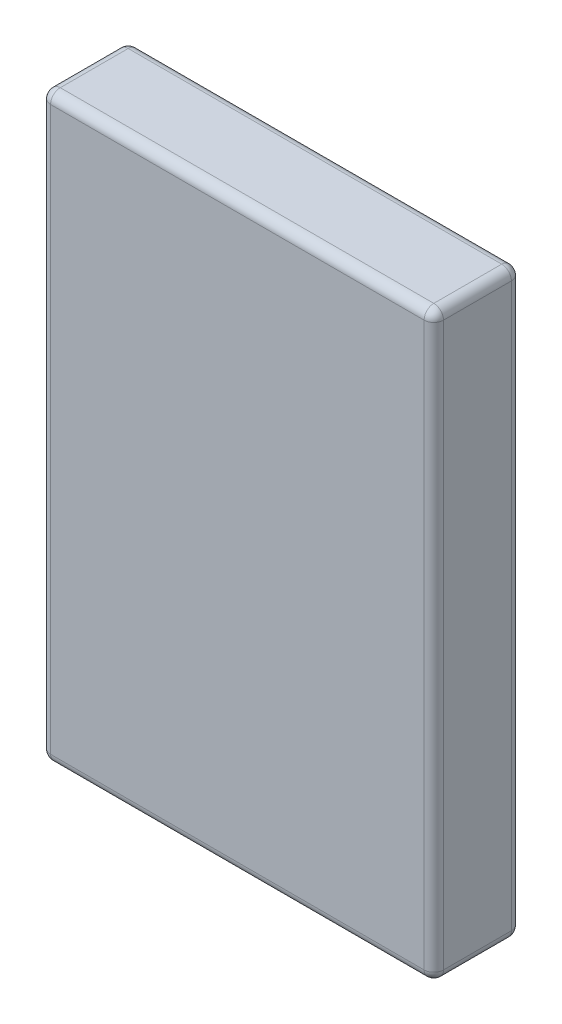
ISO-10303-21;
HEADER;
FILE_DESCRIPTION(('STEP AP214'),'2;1');
FILE_NAME('part.step','',(''),(''),'','','');
FILE_SCHEMA(('AUTOMOTIVE_DESIGN { 1 0 10303 214 1 1 1 1 }'));
ENDSEC;
DATA;
#1=APPLICATION_CONTEXT('core data for automotive mechanical design processes');
#2=APPLICATION_PROTOCOL_DEFINITION('international standard','automotive_design',2000,#1);
#3=PRODUCT_CONTEXT('',#1,'mechanical');
#4=PRODUCT('Part','Part','',(#3));
#5=PRODUCT_RELATED_PRODUCT_CATEGORY('part','',(#4));
#6=PRODUCT_DEFINITION_FORMATION('','',#4);
#7=PRODUCT_DEFINITION_CONTEXT('part definition',#1,'design');
#8=PRODUCT_DEFINITION('design','',#6,#7);
#9=PRODUCT_DEFINITION_SHAPE('','',#8);
#10=(LENGTH_UNIT() NAMED_UNIT(*) SI_UNIT(.MILLI.,.METRE.));
#11=(NAMED_UNIT(*) PLANE_ANGLE_UNIT() SI_UNIT($,.RADIAN.));
#12=(NAMED_UNIT(*) SI_UNIT($,.STERADIAN.) SOLID_ANGLE_UNIT());
#13=UNCERTAINTY_MEASURE_WITH_UNIT(LENGTH_MEASURE(1.E-05),#10,'distance_accuracy_value','');
#14=(GEOMETRIC_REPRESENTATION_CONTEXT(3) GLOBAL_UNCERTAINTY_ASSIGNED_CONTEXT((#13)) GLOBAL_UNIT_ASSIGNED_CONTEXT((#10,
#11,#12)) REPRESENTATION_CONTEXT('',''));
#15=CARTESIAN_POINT('',(0.,0.,0.));
#16=DIRECTION('',(0.,0.,1.));
#17=DIRECTION('',(1.,0.,0.));
#18=AXIS2_PLACEMENT_3D('',#15,#16,#17);
#19=CARTESIAN_POINT('',(81.,240.,-18.));
#20=DIRECTION('',(-1.,0.,0.));
#21=DIRECTION('',(0.,0.,1.));
#22=AXIS2_PLACEMENT_3D('',#19,#20,#21);
#23=PLANE('',#22);
#24=DIRECTION('',(0.,0.,-1.));
#25=VECTOR('',#24,1.);
#26=CARTESIAN_POINT('',(81.,4.,-18.));
#27=LINE('',#26,#25);
#28=CARTESIAN_POINT('',(81.,4.,14.));
#29=VERTEX_POINT('',#28);
#30=CARTESIAN_POINT('',(81.,4.,-14.));
#31=VERTEX_POINT('',#30);
#32=EDGE_CURVE('E42',#29,#31,#27,.T.);
#33=ORIENTED_EDGE('',*,*,#32,.T.);
#34=DIRECTION('',(0.,-1.,0.));
#35=VECTOR('',#34,1.);
#36=CARTESIAN_POINT('',(81.,240.,-14.));
#37=LINE('',#36,#35);
#38=CARTESIAN_POINT('',(81.,236.,-14.));
#39=VERTEX_POINT('',#38);
#40=EDGE_CURVE('E11',#31,#39,#37,.F.);
#41=ORIENTED_EDGE('',*,*,#40,.T.);
#42=DIRECTION('',(0.,0.,-1.));
#43=VECTOR('',#42,1.);
#44=CARTESIAN_POINT('',(81.,236.,18.));
#45=LINE('',#44,#43);
#46=CARTESIAN_POINT('',(81.,236.,14.));
#47=VERTEX_POINT('',#46);
#48=EDGE_CURVE('E200',#39,#47,#45,.F.);
#49=ORIENTED_EDGE('',*,*,#48,.T.);
#50=DIRECTION('',(0.,-1.,0.));
#51=VECTOR('',#50,1.);
#52=CARTESIAN_POINT('',(81.,240.,14.));
#53=LINE('',#52,#51);
#54=EDGE_CURVE('E198',#47,#29,#53,.T.);
#55=ORIENTED_EDGE('',*,*,#54,.T.);
#56=EDGE_LOOP('',(#33,#41,#49,#55));
#57=FACE_BOUND('',#56,.T.);
#58=ADVANCED_FACE('F33',(#57),#23,.F.);
#59=CARTESIAN_POINT('',(-81.,240.,-18.));
#60=DIRECTION('',(0.,0.,1.));
#61=DIRECTION('',(1.,0.,0.));
#62=AXIS2_PLACEMENT_3D('',#59,#60,#61);
#63=PLANE('',#62);
#64=DIRECTION('',(-1.,0.,0.));
#65=VECTOR('',#64,1.);
#66=CARTESIAN_POINT('',(-81.,4.,-18.));
#67=LINE('',#66,#65);
#68=CARTESIAN_POINT('',(77.,4.,-18.));
#69=VERTEX_POINT('',#68);
#70=CARTESIAN_POINT('',(-77.,4.,-18.));
#71=VERTEX_POINT('',#70);
#72=EDGE_CURVE('E168',#69,#71,#67,.T.);
#73=ORIENTED_EDGE('',*,*,#72,.T.);
#74=DIRECTION('',(0.,-1.,0.));
#75=VECTOR('',#74,1.);
#76=CARTESIAN_POINT('',(-77.,240.,-18.));
#77=LINE('',#76,#75);
#78=CARTESIAN_POINT('',(-77.,236.,-18.));
#79=VERTEX_POINT('',#78);
#80=EDGE_CURVE('E132',#71,#79,#77,.F.);
#81=ORIENTED_EDGE('',*,*,#80,.T.);
#82=DIRECTION('',(-1.,0.,0.));
#83=VECTOR('',#82,1.);
#84=CARTESIAN_POINT('',(81.,236.,-18.));
#85=LINE('',#84,#83);
#86=CARTESIAN_POINT('',(77.,236.,-18.));
#87=VERTEX_POINT('',#86);
#88=EDGE_CURVE('E160',#79,#87,#85,.F.);
#89=ORIENTED_EDGE('',*,*,#88,.T.);
#90=DIRECTION('',(0.,-1.,0.));
#91=VECTOR('',#90,1.);
#92=CARTESIAN_POINT('',(77.,240.,-18.));
#93=LINE('',#92,#91);
#94=EDGE_CURVE('E162',#87,#69,#93,.T.);
#95=ORIENTED_EDGE('',*,*,#94,.T.);
#96=EDGE_LOOP('',(#73,#81,#89,#95));
#97=FACE_BOUND('',#96,.T.);
#98=ADVANCED_FACE('F300',(#97),#63,.F.);
#99=CARTESIAN_POINT('',(-81.,240.,-18.));
#100=DIRECTION('',(1.,0.,0.));
#101=DIRECTION('',(0.,0.,-1.));
#102=AXIS2_PLACEMENT_3D('',#99,#100,#101);
#103=PLANE('',#102);
#104=DIRECTION('',(0.,0.,1.));
#105=VECTOR('',#104,1.);
#106=CARTESIAN_POINT('',(-81.,236.,-18.));
#107=LINE('',#106,#105);
#108=CARTESIAN_POINT('',(-81.,236.,14.));
#109=VERTEX_POINT('',#108);
#110=CARTESIAN_POINT('',(-81.,236.,-14.));
#111=VERTEX_POINT('',#110);
#112=EDGE_CURVE('E158',#109,#111,#107,.F.);
#113=ORIENTED_EDGE('',*,*,#112,.T.);
#114=DIRECTION('',(0.,-1.,0.));
#115=VECTOR('',#114,1.);
#116=CARTESIAN_POINT('',(-81.,240.,-14.));
#117=LINE('',#116,#115);
#118=CARTESIAN_POINT('',(-81.,4.,-14.));
#119=VERTEX_POINT('',#118);
#120=EDGE_CURVE('E130',#111,#119,#117,.T.);
#121=ORIENTED_EDGE('',*,*,#120,.T.);
#122=DIRECTION('',(0.,0.,1.));
#123=VECTOR('',#122,1.);
#124=CARTESIAN_POINT('',(-81.,4.,-18.));
#125=LINE('',#124,#123);
#126=CARTESIAN_POINT('',(-81.,4.,14.));
#127=VERTEX_POINT('',#126);
#128=EDGE_CURVE('E148',#119,#127,#125,.T.);
#129=ORIENTED_EDGE('',*,*,#128,.T.);
#130=DIRECTION('',(0.,-1.,0.));
#131=VECTOR('',#130,1.);
#132=CARTESIAN_POINT('',(-81.,240.,14.));
#133=LINE('',#132,#131);
#134=EDGE_CURVE('E154',#127,#109,#133,.F.);
#135=ORIENTED_EDGE('',*,*,#134,.T.);
#136=EDGE_LOOP('',(#113,#121,#129,#135));
#137=FACE_BOUND('',#136,.T.);
#138=ADVANCED_FACE('F156',(#137),#103,.F.);
#139=CARTESIAN_POINT('',(-81.,240.,18.));
#140=DIRECTION('',(0.,0.,-1.));
#141=DIRECTION('',(-1.,0.,0.));
#142=AXIS2_PLACEMENT_3D('',#139,#140,#141);
#143=PLANE('',#142);
#144=DIRECTION('',(1.,0.,0.));
#145=VECTOR('',#144,1.);
#146=CARTESIAN_POINT('',(-81.,236.,18.));
#147=LINE('',#146,#145);
#148=CARTESIAN_POINT('',(77.,236.,18.));
#149=VERTEX_POINT('',#148);
#150=CARTESIAN_POINT('',(-77.,236.,18.));
#151=VERTEX_POINT('',#150);
#152=EDGE_CURVE('E180',#149,#151,#147,.F.);
#153=ORIENTED_EDGE('',*,*,#152,.T.);
#154=DIRECTION('',(0.,-1.,0.));
#155=VECTOR('',#154,1.);
#156=CARTESIAN_POINT('',(-77.,240.,18.));
#157=LINE('',#156,#155);
#158=CARTESIAN_POINT('',(-77.,4.,18.));
#159=VERTEX_POINT('',#158);
#160=EDGE_CURVE('E186',#151,#159,#157,.T.);
#161=ORIENTED_EDGE('',*,*,#160,.T.);
#162=DIRECTION('',(1.,0.,0.));
#163=VECTOR('',#162,1.);
#164=CARTESIAN_POINT('',(-81.,4.,18.));
#165=LINE('',#164,#163);
#166=CARTESIAN_POINT('',(77.,4.,18.));
#167=VERTEX_POINT('',#166);
#168=EDGE_CURVE('E184',#159,#167,#165,.T.);
#169=ORIENTED_EDGE('',*,*,#168,.T.);
#170=DIRECTION('',(0.,-1.,0.));
#171=VECTOR('',#170,1.);
#172=CARTESIAN_POINT('',(77.,240.,18.));
#173=LINE('',#172,#171);
#174=EDGE_CURVE('E182',#167,#149,#173,.F.);
#175=ORIENTED_EDGE('',*,*,#174,.T.);
#176=EDGE_LOOP('',(#153,#161,#169,#175));
#177=FACE_BOUND('',#176,.T.);
#178=ADVANCED_FACE('F282',(#177),#143,.F.);
#179=CARTESIAN_POINT('',(0.,240.,0.));
#180=DIRECTION('',(0.,1.,0.));
#181=DIRECTION('',(0.,0.,1.));
#182=AXIS2_PLACEMENT_3D('',#179,#180,#181);
#183=PLANE('',#182);
#184=DIRECTION('',(0.,0.,-1.));
#185=VECTOR('',#184,1.);
#186=CARTESIAN_POINT('',(77.,240.,-18.));
#187=LINE('',#186,#185);
#188=CARTESIAN_POINT('',(77.,240.,14.));
#189=VERTEX_POINT('',#188);
#190=CARTESIAN_POINT('',(77.,240.,-14.));
#191=VERTEX_POINT('',#190);
#192=EDGE_CURVE('E173',#189,#191,#187,.T.);
#193=ORIENTED_EDGE('',*,*,#192,.T.);
#194=DIRECTION('',(-1.,0.,0.));
#195=VECTOR('',#194,1.);
#196=CARTESIAN_POINT('',(-81.,240.,-14.));
#197=LINE('',#196,#195);
#198=CARTESIAN_POINT('',(-77.,240.,-14.));
#199=VERTEX_POINT('',#198);
#200=EDGE_CURVE('E178',#191,#199,#197,.T.);
#201=ORIENTED_EDGE('',*,*,#200,.T.);
#202=DIRECTION('',(0.,0.,1.));
#203=VECTOR('',#202,1.);
#204=CARTESIAN_POINT('',(-77.,240.,18.));
#205=LINE('',#204,#203);
#206=CARTESIAN_POINT('',(-77.,240.,14.));
#207=VERTEX_POINT('',#206);
#208=EDGE_CURVE('E175',#199,#207,#205,.T.);
#209=ORIENTED_EDGE('',*,*,#208,.T.);
#210=DIRECTION('',(1.,0.,0.));
#211=VECTOR('',#210,1.);
#212=CARTESIAN_POINT('',(81.,240.,14.));
#213=LINE('',#212,#211);
#214=EDGE_CURVE('E171',#207,#189,#213,.T.);
#215=ORIENTED_EDGE('',*,*,#214,.T.);
#216=EDGE_LOOP('',(#193,#201,#209,#215));
#217=FACE_BOUND('',#216,.T.);
#218=ADVANCED_FACE('F273',(#217),#183,.T.);
#219=CARTESIAN_POINT('',(0.,0.,0.));
#220=DIRECTION('',(0.,1.,0.));
#221=DIRECTION('',(0.,0.,1.));
#222=AXIS2_PLACEMENT_3D('',#219,#220,#221);
#223=PLANE('',#222);
#224=DIRECTION('',(0.,0.,1.));
#225=VECTOR('',#224,1.);
#226=CARTESIAN_POINT('',(-77.,0.,0.));
#227=LINE('',#226,#225);
#228=CARTESIAN_POINT('',(-77.,0.,14.));
#229=VERTEX_POINT('',#228);
#230=CARTESIAN_POINT('',(-77.,0.,-14.));
#231=VERTEX_POINT('',#230);
#232=EDGE_CURVE('E193',#229,#231,#227,.F.);
#233=ORIENTED_EDGE('',*,*,#232,.T.);
#234=DIRECTION('',(-1.,0.,0.));
#235=VECTOR('',#234,1.);
#236=CARTESIAN_POINT('',(0.,0.,-14.));
#237=LINE('',#236,#235);
#238=CARTESIAN_POINT('',(77.,0.,-14.));
#239=VERTEX_POINT('',#238);
#240=EDGE_CURVE('E196',#231,#239,#237,.F.);
#241=ORIENTED_EDGE('',*,*,#240,.T.);
#242=DIRECTION('',(0.,0.,-1.));
#243=VECTOR('',#242,1.);
#244=CARTESIAN_POINT('',(77.,0.,0.));
#245=LINE('',#244,#243);
#246=CARTESIAN_POINT('',(77.,0.,14.));
#247=VERTEX_POINT('',#246);
#248=EDGE_CURVE('E191',#239,#247,#245,.F.);
#249=ORIENTED_EDGE('',*,*,#248,.T.);
#250=DIRECTION('',(1.,0.,0.));
#251=VECTOR('',#250,1.);
#252=CARTESIAN_POINT('',(0.,0.,14.));
#253=LINE('',#252,#251);
#254=EDGE_CURVE('E189',#247,#229,#253,.F.);
#255=ORIENTED_EDGE('',*,*,#254,.T.);
#256=EDGE_LOOP('',(#233,#241,#249,#255));
#257=FACE_BOUND('',#256,.T.);
#258=ADVANCED_FACE('F364',(#257),#223,.F.);
#259=CARTESIAN_POINT('',(77.,240.,14.));
#260=DIRECTION('',(0.,-1.,0.));
#261=DIRECTION('',(0.,0.,-1.));
#262=AXIS2_PLACEMENT_3D('',#259,#260,#261);
#263=CYLINDRICAL_SURFACE('',#262,4.);
#264=CARTESIAN_POINT('',(77.,236.,14.));
#265=DIRECTION('',(0.,1.,0.));
#266=DIRECTION('',(0.,0.,1.));
#267=AXIS2_PLACEMENT_3D('',#264,#265,#266);
#268=CIRCLE('',#267,4.);
#269=EDGE_CURVE('E37',#149,#47,#268,.T.);
#270=ORIENTED_EDGE('',*,*,#269,.F.);
#271=ORIENTED_EDGE('',*,*,#174,.F.);
#272=CARTESIAN_POINT('',(77.,4.,14.));
#273=DIRECTION('',(0.,-1.,0.));
#274=DIRECTION('',(0.,0.,-1.));
#275=AXIS2_PLACEMENT_3D('',#272,#273,#274);
#276=CIRCLE('',#275,4.);
#277=EDGE_CURVE('E250',#29,#167,#276,.T.);
#278=ORIENTED_EDGE('',*,*,#277,.F.);
#279=ORIENTED_EDGE('',*,*,#54,.F.);
#280=EDGE_LOOP('',(#270,#271,#278,#279));
#281=FACE_BOUND('',#280,.T.);
#282=ADVANCED_FACE('F35',(#281),#263,.T.);
#283=CARTESIAN_POINT('',(77.,236.,14.));
#284=DIRECTION('',(0.,0.,1.));
#285=DIRECTION('',(1.,0.,0.));
#286=AXIS2_PLACEMENT_3D('',#283,#284,#285);
#287=SPHERICAL_SURFACE('',#286,4.);
#288=CARTESIAN_POINT('',(77.,236.,14.));
#289=DIRECTION('',(1.,0.,0.));
#290=DIRECTION('',(0.,0.,-1.));
#291=AXIS2_PLACEMENT_3D('',#288,#289,#290);
#292=CIRCLE('',#291,4.);
#293=EDGE_CURVE('E245',#149,#189,#292,.F.);
#294=ORIENTED_EDGE('',*,*,#293,.F.);
#295=ORIENTED_EDGE('',*,*,#269,.T.);
#296=CARTESIAN_POINT('',(77.,236.,14.));
#297=DIRECTION('',(0.,0.,1.));
#298=DIRECTION('',(0.,-1.,0.));
#299=AXIS2_PLACEMENT_3D('',#296,#297,#298);
#300=CIRCLE('',#299,4.);
#301=EDGE_CURVE('E248',#189,#47,#300,.F.);
#302=ORIENTED_EDGE('',*,*,#301,.F.);
#303=EDGE_LOOP('',(#294,#295,#302));
#304=FACE_BOUND('',#303,.T.);
#305=ADVANCED_FACE('F261',(#304),#287,.T.);
#306=CARTESIAN_POINT('',(77.,4.,14.));
#307=DIRECTION('',(0.,0.,1.));
#308=DIRECTION('',(1.,0.,0.));
#309=AXIS2_PLACEMENT_3D('',#306,#307,#308);
#310=SPHERICAL_SURFACE('',#309,4.);
#311=CARTESIAN_POINT('',(77.,4.,14.));
#312=DIRECTION('',(0.,0.,1.));
#313=DIRECTION('',(1.,0.,0.));
#314=AXIS2_PLACEMENT_3D('',#311,#312,#313);
#315=CIRCLE('',#314,4.);
#316=EDGE_CURVE('E239',#29,#247,#315,.F.);
#317=ORIENTED_EDGE('',*,*,#316,.F.);
#318=ORIENTED_EDGE('',*,*,#277,.T.);
#319=CARTESIAN_POINT('',(77.,4.,14.));
#320=DIRECTION('',(1.,0.,0.));
#321=DIRECTION('',(0.,0.,-1.));
#322=AXIS2_PLACEMENT_3D('',#319,#320,#321);
#323=CIRCLE('',#322,4.);
#324=EDGE_CURVE('E242',#247,#167,#323,.F.);
#325=ORIENTED_EDGE('',*,*,#324,.F.);
#326=EDGE_LOOP('',(#317,#318,#325));
#327=FACE_BOUND('',#326,.T.);
#328=ADVANCED_FACE('F295',(#327),#310,.T.);
#329=CARTESIAN_POINT('',(77.,236.,0.));
#330=DIRECTION('',(0.,0.,1.));
#331=DIRECTION('',(1.,0.,0.));
#332=AXIS2_PLACEMENT_3D('',#329,#330,#331);
#333=CYLINDRICAL_SURFACE('',#332,4.);
#334=ORIENTED_EDGE('',*,*,#301,.T.);
#335=ORIENTED_EDGE('',*,*,#48,.F.);
#336=CARTESIAN_POINT('',(77.,236.,-14.));
#337=DIRECTION('',(0.,0.,-1.));
#338=DIRECTION('',(-1.,0.,0.));
#339=AXIS2_PLACEMENT_3D('',#336,#337,#338);
#340=CIRCLE('',#339,4.);
#341=EDGE_CURVE('E233',#191,#39,#340,.T.);
#342=ORIENTED_EDGE('',*,*,#341,.F.);
#343=ORIENTED_EDGE('',*,*,#192,.F.);
#344=EDGE_LOOP('',(#334,#335,#342,#343));
#345=FACE_BOUND('',#344,.T.);
#346=ADVANCED_FACE('F268',(#345),#333,.T.);
#347=CARTESIAN_POINT('',(0.,236.,14.));
#348=DIRECTION('',(-1.,0.,0.));
#349=DIRECTION('',(0.,0.,1.));
#350=AXIS2_PLACEMENT_3D('',#347,#348,#349);
#351=CYLINDRICAL_SURFACE('',#350,4.);
#352=ORIENTED_EDGE('',*,*,#293,.T.);
#353=ORIENTED_EDGE('',*,*,#214,.F.);
#354=CARTESIAN_POINT('',(-77.,236.,14.));
#355=DIRECTION('',(-1.,0.,0.));
#356=DIRECTION('',(0.,0.,1.));
#357=AXIS2_PLACEMENT_3D('',#354,#355,#356);
#358=CIRCLE('',#357,4.);
#359=EDGE_CURVE('E230',#151,#207,#358,.T.);
#360=ORIENTED_EDGE('',*,*,#359,.F.);
#361=ORIENTED_EDGE('',*,*,#152,.F.);
#362=EDGE_LOOP('',(#352,#353,#360,#361));
#363=FACE_BOUND('',#362,.T.);
#364=ADVANCED_FACE('F279',(#363),#351,.T.);
#365=CARTESIAN_POINT('',(-77.,240.,14.));
#366=DIRECTION('',(0.,-1.,0.));
#367=DIRECTION('',(0.,0.,-1.));
#368=AXIS2_PLACEMENT_3D('',#365,#366,#367);
#369=CYLINDRICAL_SURFACE('',#368,4.);
#370=CARTESIAN_POINT('',(-77.,4.,14.));
#371=DIRECTION('',(0.,-1.,0.));
#372=DIRECTION('',(0.,0.,-1.));
#373=AXIS2_PLACEMENT_3D('',#370,#371,#372);
#374=CIRCLE('',#373,4.);
#375=EDGE_CURVE('E224',#159,#127,#374,.T.);
#376=ORIENTED_EDGE('',*,*,#375,.F.);
#377=ORIENTED_EDGE('',*,*,#160,.F.);
#378=CARTESIAN_POINT('',(-77.,236.,14.));
#379=DIRECTION('',(0.,1.,0.));
#380=DIRECTION('',(0.,0.,1.));
#381=AXIS2_PLACEMENT_3D('',#378,#379,#380);
#382=CIRCLE('',#381,4.);
#383=EDGE_CURVE('E227',#109,#151,#382,.T.);
#384=ORIENTED_EDGE('',*,*,#383,.F.);
#385=ORIENTED_EDGE('',*,*,#134,.F.);
#386=EDGE_LOOP('',(#376,#377,#384,#385));
#387=FACE_BOUND('',#386,.T.);
#388=ADVANCED_FACE('F286',(#387),#369,.T.);
#389=CARTESIAN_POINT('',(-81.,4.,14.));
#390=DIRECTION('',(1.,0.,0.));
#391=DIRECTION('',(0.,0.,-1.));
#392=AXIS2_PLACEMENT_3D('',#389,#390,#391);
#393=CYLINDRICAL_SURFACE('',#392,4.);
#394=ORIENTED_EDGE('',*,*,#324,.T.);
#395=ORIENTED_EDGE('',*,*,#168,.F.);
#396=CARTESIAN_POINT('',(-77.,4.,14.));
#397=DIRECTION('',(-1.,0.,0.));
#398=DIRECTION('',(0.,0.,1.));
#399=AXIS2_PLACEMENT_3D('',#396,#397,#398);
#400=CIRCLE('',#399,4.);
#401=EDGE_CURVE('E222',#229,#159,#400,.T.);
#402=ORIENTED_EDGE('',*,*,#401,.F.);
#403=ORIENTED_EDGE('',*,*,#254,.F.);
#404=EDGE_LOOP('',(#394,#395,#402,#403));
#405=FACE_BOUND('',#404,.T.);
#406=ADVANCED_FACE('F292',(#405),#393,.T.);
#407=CARTESIAN_POINT('',(77.,4.,-18.));
#408=DIRECTION('',(0.,0.,-1.));
#409=DIRECTION('',(-1.,0.,0.));
#410=AXIS2_PLACEMENT_3D('',#407,#408,#409);
#411=CYLINDRICAL_SURFACE('',#410,4.);
#412=ORIENTED_EDGE('',*,*,#316,.T.);
#413=ORIENTED_EDGE('',*,*,#248,.F.);
#414=CARTESIAN_POINT('',(77.,4.,-14.));
#415=DIRECTION('',(0.,0.,-1.));
#416=DIRECTION('',(-1.,0.,0.));
#417=AXIS2_PLACEMENT_3D('',#414,#415,#416);
#418=CIRCLE('',#417,4.);
#419=EDGE_CURVE('E220',#31,#239,#418,.T.);
#420=ORIENTED_EDGE('',*,*,#419,.F.);
#421=ORIENTED_EDGE('',*,*,#32,.F.);
#422=EDGE_LOOP('',(#412,#413,#420,#421));
#423=FACE_BOUND('',#422,.T.);
#424=ADVANCED_FACE('F298',(#423),#411,.T.);
#425=CARTESIAN_POINT('',(77.,240.,-14.));
#426=DIRECTION('',(0.,-1.,0.));
#427=DIRECTION('',(0.,0.,-1.));
#428=AXIS2_PLACEMENT_3D('',#425,#426,#427);
#429=CYLINDRICAL_SURFACE('',#428,4.);
#430=CARTESIAN_POINT('',(77.,236.,-14.));
#431=DIRECTION('',(0.,1.,0.));
#432=DIRECTION('',(0.,0.,1.));
#433=AXIS2_PLACEMENT_3D('',#430,#431,#432);
#434=CIRCLE('',#433,4.);
#435=EDGE_CURVE('E236',#39,#87,#434,.T.);
#436=ORIENTED_EDGE('',*,*,#435,.F.);
#437=ORIENTED_EDGE('',*,*,#40,.F.);
#438=CARTESIAN_POINT('',(77.,4.,-14.));
#439=DIRECTION('',(0.,-1.,0.));
#440=DIRECTION('',(0.,0.,-1.));
#441=AXIS2_PLACEMENT_3D('',#438,#439,#440);
#442=CIRCLE('',#441,4.);
#443=EDGE_CURVE('E50',#69,#31,#442,.T.);
#444=ORIENTED_EDGE('',*,*,#443,.F.);
#445=ORIENTED_EDGE('',*,*,#94,.F.);
#446=EDGE_LOOP('',(#436,#437,#444,#445));
#447=FACE_BOUND('',#446,.T.);
#448=ADVANCED_FACE('F344',(#447),#429,.T.);
#449=CARTESIAN_POINT('',(77.,236.,-14.));
#450=DIRECTION('',(0.,0.,1.));
#451=DIRECTION('',(1.,0.,0.));
#452=AXIS2_PLACEMENT_3D('',#449,#450,#451);
#453=SPHERICAL_SURFACE('',#452,4.);
#454=ORIENTED_EDGE('',*,*,#341,.T.);
#455=ORIENTED_EDGE('',*,*,#435,.T.);
#456=CARTESIAN_POINT('',(77.,236.,-14.));
#457=DIRECTION('',(1.,0.,0.));
#458=DIRECTION('',(0.,0.,-1.));
#459=AXIS2_PLACEMENT_3D('',#456,#457,#458);
#460=CIRCLE('',#459,4.);
#461=EDGE_CURVE('E216',#191,#87,#460,.F.);
#462=ORIENTED_EDGE('',*,*,#461,.F.);
#463=EDGE_LOOP('',(#454,#455,#462));
#464=FACE_BOUND('',#463,.T.);
#465=ADVANCED_FACE('F340',(#464),#453,.T.);
#466=CARTESIAN_POINT('',(-77.,236.,14.));
#467=DIRECTION('',(0.,0.,1.));
#468=DIRECTION('',(1.,0.,0.));
#469=AXIS2_PLACEMENT_3D('',#466,#467,#468);
#470=SPHERICAL_SURFACE('',#469,4.);
#471=ORIENTED_EDGE('',*,*,#383,.T.);
#472=ORIENTED_EDGE('',*,*,#359,.T.);
#473=CARTESIAN_POINT('',(-77.,236.,14.));
#474=DIRECTION('',(0.,0.,1.));
#475=DIRECTION('',(1.,0.,0.));
#476=AXIS2_PLACEMENT_3D('',#473,#474,#475);
#477=CIRCLE('',#476,4.);
#478=EDGE_CURVE('E214',#109,#207,#477,.F.);
#479=ORIENTED_EDGE('',*,*,#478,.F.);
#480=EDGE_LOOP('',(#471,#472,#479));
#481=FACE_BOUND('',#480,.T.);
#482=ADVANCED_FACE('F337',(#481),#470,.T.);
#483=CARTESIAN_POINT('',(-77.,4.,14.));
#484=DIRECTION('',(0.,0.,1.));
#485=DIRECTION('',(1.,0.,0.));
#486=AXIS2_PLACEMENT_3D('',#483,#484,#485);
#487=SPHERICAL_SURFACE('',#486,4.);
#488=ORIENTED_EDGE('',*,*,#401,.T.);
#489=ORIENTED_EDGE('',*,*,#375,.T.);
#490=CARTESIAN_POINT('',(-77.,4.,14.));
#491=DIRECTION('',(0.,0.,1.));
#492=DIRECTION('',(1.,0.,0.));
#493=AXIS2_PLACEMENT_3D('',#490,#491,#492);
#494=CIRCLE('',#493,4.);
#495=EDGE_CURVE('E151',#229,#127,#494,.F.);
#496=ORIENTED_EDGE('',*,*,#495,.F.);
#497=EDGE_LOOP('',(#488,#489,#496));
#498=FACE_BOUND('',#497,.T.);
#499=ADVANCED_FACE('F334',(#498),#487,.T.);
#500=CARTESIAN_POINT('',(77.,4.,-14.));
#501=DIRECTION('',(0.,0.,1.));
#502=DIRECTION('',(1.,0.,0.));
#503=AXIS2_PLACEMENT_3D('',#500,#501,#502);
#504=SPHERICAL_SURFACE('',#503,4.);
#505=ORIENTED_EDGE('',*,*,#443,.T.);
#506=ORIENTED_EDGE('',*,*,#419,.T.);
#507=CARTESIAN_POINT('',(77.,4.,-14.));
#508=DIRECTION('',(1.,0.,0.));
#509=DIRECTION('',(0.,0.,-1.));
#510=AXIS2_PLACEMENT_3D('',#507,#508,#509);
#511=CIRCLE('',#510,4.);
#512=EDGE_CURVE('E210',#69,#239,#511,.F.);
#513=ORIENTED_EDGE('',*,*,#512,.F.);
#514=EDGE_LOOP('',(#505,#506,#513));
#515=FACE_BOUND('',#514,.T.);
#516=ADVANCED_FACE('F330',(#515),#504,.T.);
#517=CARTESIAN_POINT('',(0.,236.,-14.));
#518=DIRECTION('',(1.,0.,0.));
#519=DIRECTION('',(0.,0.,-1.));
#520=AXIS2_PLACEMENT_3D('',#517,#518,#519);
#521=CYLINDRICAL_SURFACE('',#520,4.);
#522=ORIENTED_EDGE('',*,*,#461,.T.);
#523=ORIENTED_EDGE('',*,*,#88,.F.);
#524=CARTESIAN_POINT('',(-77.,236.,-14.));
#525=DIRECTION('',(-1.,0.,0.));
#526=DIRECTION('',(0.,0.,1.));
#527=AXIS2_PLACEMENT_3D('',#524,#525,#526);
#528=CIRCLE('',#527,4.);
#529=EDGE_CURVE('E207',#199,#79,#528,.T.);
#530=ORIENTED_EDGE('',*,*,#529,.F.);
#531=ORIENTED_EDGE('',*,*,#200,.F.);
#532=EDGE_LOOP('',(#522,#523,#530,#531));
#533=FACE_BOUND('',#532,.T.);
#534=ADVANCED_FACE('F326',(#533),#521,.T.);
#535=CARTESIAN_POINT('',(-77.,236.,0.));
#536=DIRECTION('',(0.,0.,-1.));
#537=DIRECTION('',(-1.,0.,0.));
#538=AXIS2_PLACEMENT_3D('',#535,#536,#537);
#539=CYLINDRICAL_SURFACE('',#538,4.);
#540=ORIENTED_EDGE('',*,*,#478,.T.);
#541=ORIENTED_EDGE('',*,*,#208,.F.);
#542=CARTESIAN_POINT('',(-77.,236.,-14.));
#543=DIRECTION('',(0.,0.,-1.));
#544=DIRECTION('',(-1.,0.,0.));
#545=AXIS2_PLACEMENT_3D('',#542,#543,#544);
#546=CIRCLE('',#545,4.);
#547=EDGE_CURVE('E145',#111,#199,#546,.T.);
#548=ORIENTED_EDGE('',*,*,#547,.F.);
#549=ORIENTED_EDGE('',*,*,#112,.F.);
#550=EDGE_LOOP('',(#540,#541,#548,#549));
#551=FACE_BOUND('',#550,.T.);
#552=ADVANCED_FACE('F323',(#551),#539,.T.);
#553=CARTESIAN_POINT('',(-77.,4.,-18.));
#554=DIRECTION('',(0.,0.,1.));
#555=DIRECTION('',(1.,0.,0.));
#556=AXIS2_PLACEMENT_3D('',#553,#554,#555);
#557=CYLINDRICAL_SURFACE('',#556,4.);
#558=ORIENTED_EDGE('',*,*,#495,.T.);
#559=ORIENTED_EDGE('',*,*,#128,.F.);
#560=CARTESIAN_POINT('',(-77.,4.,-14.));
#561=DIRECTION('',(0.,0.,-1.));
#562=DIRECTION('',(-1.,0.,0.));
#563=AXIS2_PLACEMENT_3D('',#560,#561,#562);
#564=CIRCLE('',#563,4.);
#565=EDGE_CURVE('E137',#231,#119,#564,.T.);
#566=ORIENTED_EDGE('',*,*,#565,.F.);
#567=ORIENTED_EDGE('',*,*,#232,.F.);
#568=EDGE_LOOP('',(#558,#559,#566,#567));
#569=FACE_BOUND('',#568,.T.);
#570=ADVANCED_FACE('F149',(#569),#557,.T.);
#571=CARTESIAN_POINT('',(-81.,4.,-14.));
#572=DIRECTION('',(-1.,0.,0.));
#573=DIRECTION('',(0.,0.,1.));
#574=AXIS2_PLACEMENT_3D('',#571,#572,#573);
#575=CYLINDRICAL_SURFACE('',#574,4.);
#576=ORIENTED_EDGE('',*,*,#512,.T.);
#577=ORIENTED_EDGE('',*,*,#240,.F.);
#578=CARTESIAN_POINT('',(-77.,4.,-14.));
#579=DIRECTION('',(-1.,0.,0.));
#580=DIRECTION('',(0.,0.,1.));
#581=AXIS2_PLACEMENT_3D('',#578,#579,#580);
#582=CIRCLE('',#581,4.);
#583=EDGE_CURVE('E141',#71,#231,#582,.T.);
#584=ORIENTED_EDGE('',*,*,#583,.F.);
#585=ORIENTED_EDGE('',*,*,#72,.F.);
#586=EDGE_LOOP('',(#576,#577,#584,#585));
#587=FACE_BOUND('',#586,.T.);
#588=ADVANCED_FACE('F316',(#587),#575,.T.);
#589=CARTESIAN_POINT('',(-77.,236.,-14.));
#590=DIRECTION('',(0.,0.,1.));
#591=DIRECTION('',(1.,0.,0.));
#592=AXIS2_PLACEMENT_3D('',#589,#590,#591);
#593=SPHERICAL_SURFACE('',#592,4.);
#594=ORIENTED_EDGE('',*,*,#547,.T.);
#595=ORIENTED_EDGE('',*,*,#529,.T.);
#596=CARTESIAN_POINT('',(-77.,236.,-14.));
#597=DIRECTION('',(0.,1.,0.));
#598=DIRECTION('',(0.,0.,1.));
#599=AXIS2_PLACEMENT_3D('',#596,#597,#598);
#600=CIRCLE('',#599,4.);
#601=EDGE_CURVE('E134',#111,#79,#600,.F.);
#602=ORIENTED_EDGE('',*,*,#601,.F.);
#603=EDGE_LOOP('',(#594,#595,#602));
#604=FACE_BOUND('',#603,.T.);
#605=ADVANCED_FACE('F313',(#604),#593,.T.);
#606=CARTESIAN_POINT('',(-77.,4.,-14.));
#607=DIRECTION('',(0.,0.,1.));
#608=DIRECTION('',(1.,0.,0.));
#609=AXIS2_PLACEMENT_3D('',#606,#607,#608);
#610=SPHERICAL_SURFACE('',#609,4.);
#611=ORIENTED_EDGE('',*,*,#583,.T.);
#612=ORIENTED_EDGE('',*,*,#565,.T.);
#613=CARTESIAN_POINT('',(-77.,4.,-14.));
#614=DIRECTION('',(0.,-1.,0.));
#615=DIRECTION('',(0.,0.,-1.));
#616=AXIS2_PLACEMENT_3D('',#613,#614,#615);
#617=CIRCLE('',#616,4.);
#618=EDGE_CURVE('E126',#71,#119,#617,.F.);
#619=ORIENTED_EDGE('',*,*,#618,.F.);
#620=EDGE_LOOP('',(#611,#612,#619));
#621=FACE_BOUND('',#620,.T.);
#622=ADVANCED_FACE('F139',(#621),#610,.T.);
#623=CARTESIAN_POINT('',(-77.,240.,-14.));
#624=DIRECTION('',(0.,-1.,0.));
#625=DIRECTION('',(0.,0.,-1.));
#626=AXIS2_PLACEMENT_3D('',#623,#624,#625);
#627=CYLINDRICAL_SURFACE('',#626,4.);
#628=ORIENTED_EDGE('',*,*,#601,.T.);
#629=ORIENTED_EDGE('',*,*,#80,.F.);
#630=ORIENTED_EDGE('',*,*,#618,.T.);
#631=ORIENTED_EDGE('',*,*,#120,.F.);
#632=EDGE_LOOP('',(#628,#629,#630,#631));
#633=FACE_BOUND('',#632,.T.);
#634=ADVANCED_FACE('F128',(#633),#627,.T.);
#635=CLOSED_SHELL('',(#58,#98,#138,#178,#218,#258,#282,#305,#328,#346,#364,#388,#406,#424,#448,
#465,#482,#499,#516,#534,#552,#570,#588,#605,#622,#634));
#636=MANIFOLD_SOLID_BREP('B2',#635);
#637=ADVANCED_BREP_SHAPE_REPRESENTATION('',(#18,#636),#14);
#638=SHAPE_DEFINITION_REPRESENTATION(#9,#637);
ENDSEC;
END-ISO-10303-21;
